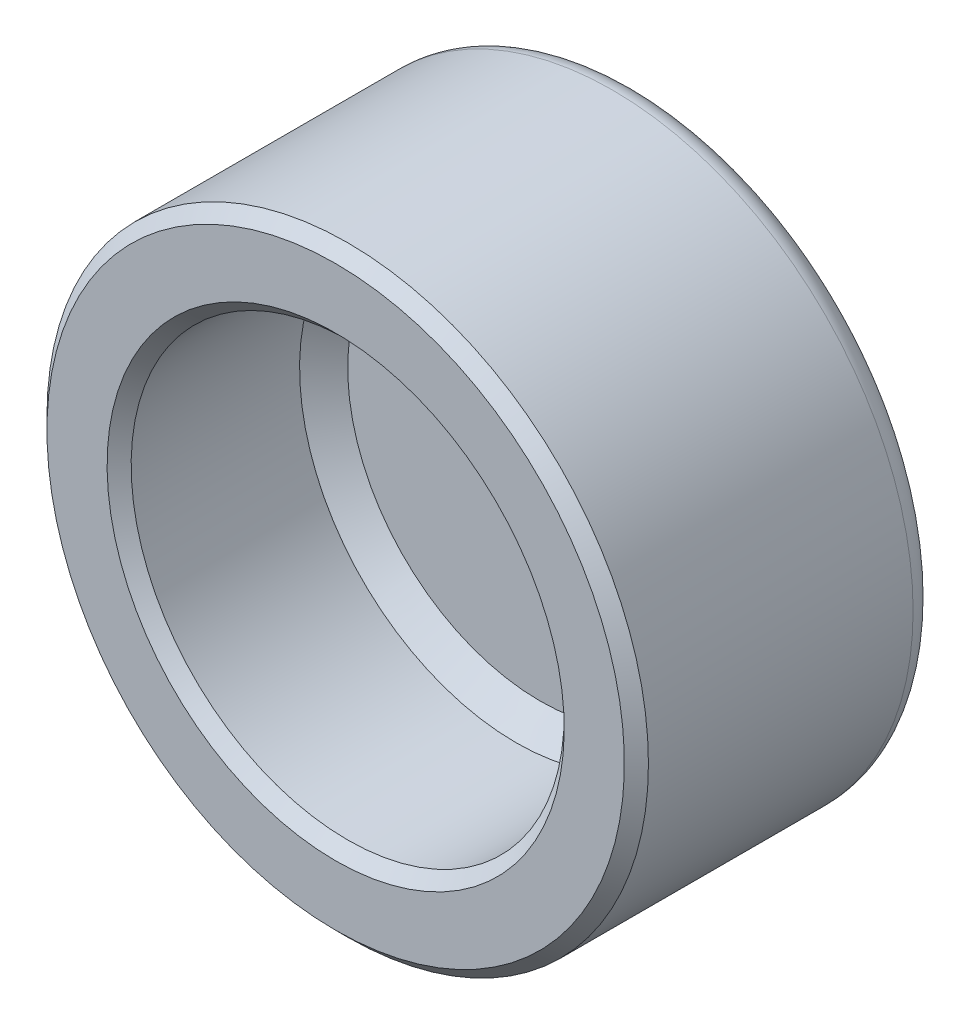
ISO-10303-21;
HEADER;
FILE_DESCRIPTION(('STEP AP214'),'2;1');
FILE_NAME('part.step','',(''),(''),'','','');
FILE_SCHEMA(('AUTOMOTIVE_DESIGN { 1 0 10303 214 1 1 1 1 }'));
ENDSEC;
DATA;
#1=APPLICATION_CONTEXT('core data for automotive mechanical design processes');
#2=APPLICATION_PROTOCOL_DEFINITION('international standard','automotive_design',2000,#1);
#3=PRODUCT_CONTEXT('',#1,'mechanical');
#4=PRODUCT('Part','Part','',(#3));
#5=PRODUCT_RELATED_PRODUCT_CATEGORY('part','',(#4));
#6=PRODUCT_DEFINITION_FORMATION('','',#4);
#7=PRODUCT_DEFINITION_CONTEXT('part definition',#1,'design');
#8=PRODUCT_DEFINITION('design','',#6,#7);
#9=PRODUCT_DEFINITION_SHAPE('','',#8);
#10=(LENGTH_UNIT() NAMED_UNIT(*) SI_UNIT(.MILLI.,.METRE.));
#11=(NAMED_UNIT(*) PLANE_ANGLE_UNIT() SI_UNIT($,.RADIAN.));
#12=(NAMED_UNIT(*) SI_UNIT($,.STERADIAN.) SOLID_ANGLE_UNIT());
#13=UNCERTAINTY_MEASURE_WITH_UNIT(LENGTH_MEASURE(1.E-05),#10,'distance_accuracy_value','');
#14=(GEOMETRIC_REPRESENTATION_CONTEXT(3) GLOBAL_UNCERTAINTY_ASSIGNED_CONTEXT((#13)) GLOBAL_UNIT_ASSIGNED_CONTEXT((#10,
#11,#12)) REPRESENTATION_CONTEXT('',''));
#15=CARTESIAN_POINT('',(0.,0.,0.));
#16=DIRECTION('',(0.,0.,1.));
#17=DIRECTION('',(1.,0.,0.));
#18=AXIS2_PLACEMENT_3D('',#15,#16,#17);
#19=CARTESIAN_POINT('',(100.,100.,1.50000000000001));
#20=DIRECTION('',(0.,0.,-1.));
#21=DIRECTION('',(-1.,0.,0.));
#22=AXIS2_PLACEMENT_3D('',#19,#20,#21);
#23=TOROIDAL_SURFACE('',#22,11.5,1.00000000000001);
#24=CARTESIAN_POINT('',(100.,100.,0.5));
#25=DIRECTION('',(0.,0.,1.));
#26=DIRECTION('',(1.,0.,0.));
#27=AXIS2_PLACEMENT_3D('',#24,#25,#26);
#28=CIRCLE('',#27,11.5);
#29=CARTESIAN_POINT('',(111.5,100.,0.5));
#30=VERTEX_POINT('',#29);
#31=EDGE_CURVE('E10',#30,#30,#28,.T.);
#32=ORIENTED_EDGE('',*,*,#31,.T.);
#33=EDGE_LOOP('',(#32));
#34=FACE_BOUND('',#33,.T.);
#35=CARTESIAN_POINT('',(100.,100.,1.5));
#36=DIRECTION('',(0.,0.,1.));
#37=DIRECTION('',(1.,0.,0.));
#38=AXIS2_PLACEMENT_3D('',#35,#36,#37);
#39=CIRCLE('',#38,12.5);
#40=CARTESIAN_POINT('',(112.5,100.,1.5));
#41=VERTEX_POINT('',#40);
#42=EDGE_CURVE('E27',#41,#41,#39,.T.);
#43=ORIENTED_EDGE('',*,*,#42,.F.);
#44=EDGE_LOOP('',(#43));
#45=FACE_BOUND('',#44,.T.);
#46=ADVANCED_FACE('F14',(#34,#45),#23,.T.);
#47=CARTESIAN_POINT('',(100.,100.,7.));
#48=DIRECTION('',(0.,0.,-1.));
#49=DIRECTION('',(0.,-1.,0.));
#50=AXIS2_PLACEMENT_3D('',#47,#48,#49);
#51=CYLINDRICAL_SURFACE('',#50,12.5);
#52=CARTESIAN_POINT('',(100.,100.,12.5));
#53=DIRECTION('',(0.,0.,-1.));
#54=DIRECTION('',(0.,-1.,0.));
#55=AXIS2_PLACEMENT_3D('',#52,#53,#54);
#56=CIRCLE('',#55,12.5);
#57=CARTESIAN_POINT('',(100.,87.5,12.5));
#58=VERTEX_POINT('',#57);
#59=EDGE_CURVE('E22',#58,#58,#56,.T.);
#60=ORIENTED_EDGE('',*,*,#59,.T.);
#61=EDGE_LOOP('',(#60));
#62=FACE_BOUND('',#61,.T.);
#63=ORIENTED_EDGE('',*,*,#42,.T.);
#64=EDGE_LOOP('',(#63));
#65=FACE_BOUND('',#64,.T.);
#66=ADVANCED_FACE('F72',(#62,#65),#51,.T.);
#67=CARTESIAN_POINT('',(100.,100.,12.5));
#68=DIRECTION('',(0.,0.,-1.));
#69=DIRECTION('',(0.,-1.,0.));
#70=AXIS2_PLACEMENT_3D('',#67,#68,#69);
#71=CONICAL_SURFACE('',#70,12.5,0.785398163397447);
#72=CARTESIAN_POINT('',(100.,100.,13.));
#73=DIRECTION('',(0.,0.,-1.));
#74=DIRECTION('',(0.,-1.,0.));
#75=AXIS2_PLACEMENT_3D('',#72,#73,#74);
#76=CIRCLE('',#75,12.);
#77=CARTESIAN_POINT('',(100.,88.,13.));
#78=VERTEX_POINT('',#77);
#79=EDGE_CURVE('E31',#78,#78,#76,.T.);
#80=ORIENTED_EDGE('',*,*,#79,.T.);
#81=EDGE_LOOP('',(#80));
#82=FACE_BOUND('',#81,.T.);
#83=ORIENTED_EDGE('',*,*,#59,.F.);
#84=EDGE_LOOP('',(#83));
#85=FACE_BOUND('',#84,.T.);
#86=ADVANCED_FACE('F76',(#82,#85),#71,.T.);
#87=CARTESIAN_POINT('',(100.,100.,0.50000000004502));
#88=DIRECTION('',(0.,0.,1.));
#89=DIRECTION('',(1.,0.,0.));
#90=AXIS2_PLACEMENT_3D('',#87,#88,#89);
#91=CONICAL_SURFACE('',#90,2.74999999996908,0.785398163340605);
#92=CARTESIAN_POINT('',(100.,100.,0.));
#93=DIRECTION('',(0.,0.,1.));
#94=DIRECTION('',(1.,0.,0.));
#95=AXIS2_PLACEMENT_3D('',#92,#93,#94);
#96=CIRCLE('',#95,2.24999999998091);
#97=CARTESIAN_POINT('',(102.249999999981,100.,0.));
#98=VERTEX_POINT('',#97);
#99=EDGE_CURVE('E35',#98,#98,#96,.T.);
#100=ORIENTED_EDGE('',*,*,#99,.T.);
#101=EDGE_LOOP('',(#100));
#102=FACE_BOUND('',#101,.T.);
#103=CARTESIAN_POINT('',(100.,100.,0.50000000004502));
#104=DIRECTION('',(0.,0.,1.));
#105=DIRECTION('',(1.,0.,0.));
#106=AXIS2_PLACEMENT_3D('',#103,#104,#105);
#107=CIRCLE('',#106,2.74999999996908);
#108=CARTESIAN_POINT('',(102.749999999969,100.,0.50000000004502));
#109=VERTEX_POINT('',#108);
#110=EDGE_CURVE('E39',#109,#109,#107,.T.);
#111=ORIENTED_EDGE('',*,*,#110,.F.);
#112=EDGE_LOOP('',(#111));
#113=FACE_BOUND('',#112,.T.);
#114=ADVANCED_FACE('F85',(#102,#113),#91,.T.);
#115=CARTESIAN_POINT('',(100.,100.,12.5));
#116=DIRECTION('',(0.,0.,1.));
#117=DIRECTION('',(1.,0.,0.));
#118=AXIS2_PLACEMENT_3D('',#115,#116,#117);
#119=CONICAL_SURFACE('',#118,8.99999999999999,0.785398163397443);
#120=CARTESIAN_POINT('',(100.,100.,12.5));
#121=DIRECTION('',(0.,0.,-1.));
#122=DIRECTION('',(0.,-1.,0.));
#123=AXIS2_PLACEMENT_3D('',#120,#121,#122);
#124=CIRCLE('',#123,8.99999999999999);
#125=CARTESIAN_POINT('',(100.,91.,12.5));
#126=VERTEX_POINT('',#125);
#127=EDGE_CURVE('E38',#126,#126,#124,.T.);
#128=ORIENTED_EDGE('',*,*,#127,.T.);
#129=EDGE_LOOP('',(#128));
#130=FACE_BOUND('',#129,.T.);
#131=CARTESIAN_POINT('',(100.,100.,13.));
#132=DIRECTION('',(0.,0.,-1.));
#133=DIRECTION('',(0.,-1.,0.));
#134=AXIS2_PLACEMENT_3D('',#131,#132,#133);
#135=CIRCLE('',#134,9.49999999999999);
#136=CARTESIAN_POINT('',(100.,90.5,13.));
#137=VERTEX_POINT('',#136);
#138=EDGE_CURVE('E42',#137,#137,#135,.T.);
#139=ORIENTED_EDGE('',*,*,#138,.F.);
#140=EDGE_LOOP('',(#139));
#141=FACE_BOUND('',#140,.T.);
#142=ADVANCED_FACE('F16',(#130,#141),#119,.F.);
#143=CARTESIAN_POINT('',(100.,100.,12.5));
#144=DIRECTION('',(0.,0.,-1.));
#145=DIRECTION('',(0.,-1.,0.));
#146=AXIS2_PLACEMENT_3D('',#143,#144,#145);
#147=CYLINDRICAL_SURFACE('',#146,9.00000000000001);
#148=ORIENTED_EDGE('',*,*,#127,.F.);
#149=EDGE_LOOP('',(#148));
#150=FACE_BOUND('',#149,.T.);
#151=CARTESIAN_POINT('',(100.,100.,5.5));
#152=DIRECTION('',(0.,0.,-1.));
#153=DIRECTION('',(0.,-1.,0.));
#154=AXIS2_PLACEMENT_3D('',#151,#152,#153);
#155=CIRCLE('',#154,9.00000000000001);
#156=CARTESIAN_POINT('',(100.,91.,5.5));
#157=VERTEX_POINT('',#156);
#158=EDGE_CURVE('E45',#157,#157,#155,.T.);
#159=ORIENTED_EDGE('',*,*,#158,.T.);
#160=EDGE_LOOP('',(#159));
#161=FACE_BOUND('',#160,.T.);
#162=ADVANCED_FACE('F68',(#150,#161),#147,.F.);
#163=CARTESIAN_POINT('',(100.,100.,4.49999999999998));
#164=DIRECTION('',(0.,0.,1.));
#165=DIRECTION('',(1.,0.,0.));
#166=AXIS2_PLACEMENT_3D('',#163,#164,#165);
#167=CONICAL_SURFACE('',#166,7.99999999999999,0.785398163397447);
#168=CARTESIAN_POINT('',(100.,100.,4.49999999999999));
#169=DIRECTION('',(0.,0.,-1.));
#170=DIRECTION('',(0.,-1.,0.));
#171=AXIS2_PLACEMENT_3D('',#168,#169,#170);
#172=CIRCLE('',#171,8.00000000000001);
#173=CARTESIAN_POINT('',(100.,92.,4.49999999999999));
#174=VERTEX_POINT('',#173);
#175=EDGE_CURVE('E18',#174,#174,#172,.T.);
#176=ORIENTED_EDGE('',*,*,#175,.T.);
#177=EDGE_LOOP('',(#176));
#178=FACE_BOUND('',#177,.T.);
#179=ORIENTED_EDGE('',*,*,#158,.F.);
#180=EDGE_LOOP('',(#179));
#181=FACE_BOUND('',#180,.T.);
#182=ADVANCED_FACE('F53',(#178,#181),#167,.F.);
#183=CARTESIAN_POINT('',(96.,100.,4.5));
#184=DIRECTION('',(0.,0.,1.));
#185=DIRECTION('',(1.,0.,0.));
#186=AXIS2_PLACEMENT_3D('',#183,#184,#185);
#187=PLANE('',#186);
#188=ORIENTED_EDGE('',*,*,#175,.F.);
#189=EDGE_LOOP('',(#188));
#190=FACE_BOUND('',#189,.T.);
#191=ADVANCED_FACE('F56',(#190),#187,.T.);
#192=CARTESIAN_POINT('',(98.875,100.,0.));
#193=DIRECTION('',(0.,0.,-1.));
#194=DIRECTION('',(-1.,0.,0.));
#195=AXIS2_PLACEMENT_3D('',#192,#193,#194);
#196=PLANE('',#195);
#197=ORIENTED_EDGE('',*,*,#99,.F.);
#198=EDGE_LOOP('',(#197));
#199=FACE_BOUND('',#198,.T.);
#200=ADVANCED_FACE('F58',(#199),#196,.T.);
#201=CARTESIAN_POINT('',(89.25,100.,13.));
#202=DIRECTION('',(0.,0.,1.));
#203=DIRECTION('',(1.,0.,0.));
#204=AXIS2_PLACEMENT_3D('',#201,#202,#203);
#205=PLANE('',#204);
#206=ORIENTED_EDGE('',*,*,#79,.F.);
#207=EDGE_LOOP('',(#206));
#208=FACE_BOUND('',#207,.T.);
#209=ORIENTED_EDGE('',*,*,#138,.T.);
#210=EDGE_LOOP('',(#209));
#211=FACE_BOUND('',#210,.T.);
#212=ADVANCED_FACE('F65',(#208,#211),#205,.T.);
#213=CARTESIAN_POINT('',(92.875,100.,0.5));
#214=DIRECTION('',(0.,0.,-1.));
#215=DIRECTION('',(-1.,0.,0.));
#216=AXIS2_PLACEMENT_3D('',#213,#214,#215);
#217=PLANE('',#216);
#218=ORIENTED_EDGE('',*,*,#31,.F.);
#219=EDGE_LOOP('',(#218));
#220=FACE_BOUND('',#219,.T.);
#221=ORIENTED_EDGE('',*,*,#110,.T.);
#222=EDGE_LOOP('',(#221));
#223=FACE_BOUND('',#222,.T.);
#224=ADVANCED_FACE('F89',(#220,#223),#217,.T.);
#225=CLOSED_SHELL('',(#46,#66,#86,#114,#142,#162,#182,#191,#200,#212,#224));
#226=MANIFOLD_SOLID_BREP('B1',#225);
#227=ADVANCED_BREP_SHAPE_REPRESENTATION('',(#18,#226),#14);
#228=SHAPE_DEFINITION_REPRESENTATION(#9,#227);
ENDSEC;
END-ISO-10303-21;
